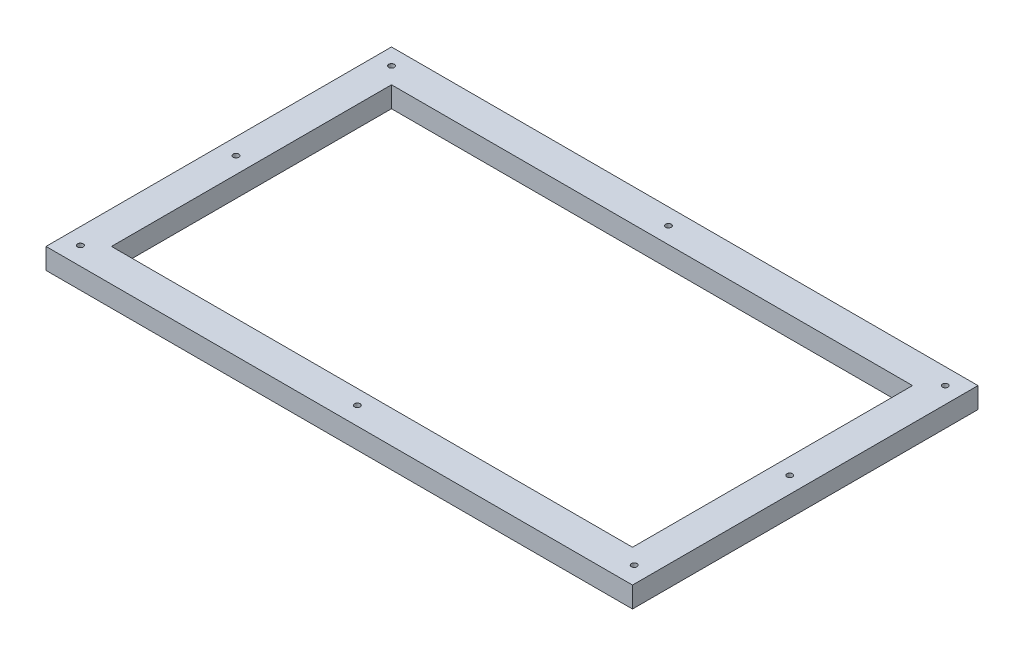
ISO-10303-21;
HEADER;
FILE_DESCRIPTION(('STEP AP214'),'2;1');
FILE_NAME('part.step','',(''),(''),'','','');
FILE_SCHEMA(('AUTOMOTIVE_DESIGN { 1 0 10303 214 1 1 1 1 }'));
ENDSEC;
DATA;
#1=APPLICATION_CONTEXT('core data for automotive mechanical design processes');
#2=APPLICATION_PROTOCOL_DEFINITION('international standard','automotive_design',2000,#1);
#3=PRODUCT_CONTEXT('',#1,'mechanical');
#4=PRODUCT('Part','Part','',(#3));
#5=PRODUCT_RELATED_PRODUCT_CATEGORY('part','',(#4));
#6=PRODUCT_DEFINITION_FORMATION('','',#4);
#7=PRODUCT_DEFINITION_CONTEXT('part definition',#1,'design');
#8=PRODUCT_DEFINITION('design','',#6,#7);
#9=PRODUCT_DEFINITION_SHAPE('','',#8);
#10=(LENGTH_UNIT() NAMED_UNIT(*) SI_UNIT(.MILLI.,.METRE.));
#11=(NAMED_UNIT(*) PLANE_ANGLE_UNIT() SI_UNIT($,.RADIAN.));
#12=(NAMED_UNIT(*) SI_UNIT($,.STERADIAN.) SOLID_ANGLE_UNIT());
#13=UNCERTAINTY_MEASURE_WITH_UNIT(LENGTH_MEASURE(1.E-05),#10,'distance_accuracy_value','');
#14=(GEOMETRIC_REPRESENTATION_CONTEXT(3) GLOBAL_UNCERTAINTY_ASSIGNED_CONTEXT((#13)) GLOBAL_UNIT_ASSIGNED_CONTEXT((#10,
#11,#12)) REPRESENTATION_CONTEXT('',''));
#15=CARTESIAN_POINT('',(0.,0.,0.));
#16=DIRECTION('',(0.,0.,1.));
#17=DIRECTION('',(1.,0.,0.));
#18=AXIS2_PLACEMENT_3D('',#15,#16,#17);
#19=CARTESIAN_POINT('',(179.135,12.7,-105.525));
#20=DIRECTION('',(-1.,0.,0.));
#21=DIRECTION('',(0.,0.,1.));
#22=AXIS2_PLACEMENT_3D('',#19,#20,#21);
#23=PLANE('',#22);
#24=DIRECTION('',(0.,0.,-1.));
#25=VECTOR('',#24,1.);
#26=CARTESIAN_POINT('',(179.135,0.,-105.525));
#27=LINE('',#26,#25);
#28=CARTESIAN_POINT('',(179.135,0.,105.525));
#29=VERTEX_POINT('',#28);
#30=CARTESIAN_POINT('',(179.135,0.,-105.525));
#31=VERTEX_POINT('',#30);
#32=EDGE_CURVE('E145',#29,#31,#27,.T.);
#33=ORIENTED_EDGE('',*,*,#32,.T.);
#34=DIRECTION('',(0.,-1.,0.));
#35=VECTOR('',#34,1.);
#36=CARTESIAN_POINT('',(179.135,12.7,-105.525));
#37=LINE('',#36,#35);
#38=CARTESIAN_POINT('',(179.135,12.7,-105.525));
#39=VERTEX_POINT('',#38);
#40=EDGE_CURVE('E11',#39,#31,#37,.T.);
#41=ORIENTED_EDGE('',*,*,#40,.F.);
#42=DIRECTION('',(0.,0.,-1.));
#43=VECTOR('',#42,1.);
#44=CARTESIAN_POINT('',(179.135,12.7,-105.525));
#45=LINE('',#44,#43);
#46=CARTESIAN_POINT('',(179.135,12.7,105.525));
#47=VERTEX_POINT('',#46);
#48=EDGE_CURVE('E149',#47,#39,#45,.T.);
#49=ORIENTED_EDGE('',*,*,#48,.F.);
#50=DIRECTION('',(0.,-1.,0.));
#51=VECTOR('',#50,1.);
#52=CARTESIAN_POINT('',(179.135,12.7,105.525));
#53=LINE('',#52,#51);
#54=EDGE_CURVE('E159',#47,#29,#53,.T.);
#55=ORIENTED_EDGE('',*,*,#54,.T.);
#56=EDGE_LOOP('',(#33,#41,#49,#55));
#57=FACE_BOUND('',#56,.T.);
#58=ADVANCED_FACE('F45',(#57),#23,.F.);
#59=CARTESIAN_POINT('',(-179.135,12.7,-105.525));
#60=DIRECTION('',(0.,0.,1.));
#61=DIRECTION('',(1.,0.,0.));
#62=AXIS2_PLACEMENT_3D('',#59,#60,#61);
#63=PLANE('',#62);
#64=DIRECTION('',(-1.,0.,0.));
#65=VECTOR('',#64,1.);
#66=CARTESIAN_POINT('',(-179.135,0.,-105.525));
#67=LINE('',#66,#65);
#68=CARTESIAN_POINT('',(-179.135,0.,-105.525));
#69=VERTEX_POINT('',#68);
#70=EDGE_CURVE('E162',#31,#69,#67,.T.);
#71=ORIENTED_EDGE('',*,*,#70,.T.);
#72=DIRECTION('',(0.,-1.,0.));
#73=VECTOR('',#72,1.);
#74=CARTESIAN_POINT('',(-179.135,12.7,-105.525));
#75=LINE('',#74,#73);
#76=CARTESIAN_POINT('',(-179.135,12.7,-105.525));
#77=VERTEX_POINT('',#76);
#78=EDGE_CURVE('E52',#77,#69,#75,.T.);
#79=ORIENTED_EDGE('',*,*,#78,.F.);
#80=DIRECTION('',(-1.,0.,0.));
#81=VECTOR('',#80,1.);
#82=CARTESIAN_POINT('',(-179.135,12.7,-105.525));
#83=LINE('',#82,#81);
#84=EDGE_CURVE('E152',#39,#77,#83,.T.);
#85=ORIENTED_EDGE('',*,*,#84,.F.);
#86=ORIENTED_EDGE('',*,*,#40,.T.);
#87=EDGE_LOOP('',(#71,#79,#85,#86));
#88=FACE_BOUND('',#87,.T.);
#89=ADVANCED_FACE('F190',(#88),#63,.F.);
#90=CARTESIAN_POINT('',(-179.135,12.7,-105.525));
#91=DIRECTION('',(1.,0.,0.));
#92=DIRECTION('',(0.,0.,-1.));
#93=AXIS2_PLACEMENT_3D('',#90,#91,#92);
#94=PLANE('',#93);
#95=DIRECTION('',(0.,0.,1.));
#96=VECTOR('',#95,1.);
#97=CARTESIAN_POINT('',(-179.135,0.,-105.525));
#98=LINE('',#97,#96);
#99=CARTESIAN_POINT('',(-179.135,0.,105.525));
#100=VERTEX_POINT('',#99);
#101=EDGE_CURVE('E164',#69,#100,#98,.T.);
#102=ORIENTED_EDGE('',*,*,#101,.T.);
#103=DIRECTION('',(0.,-1.,0.));
#104=VECTOR('',#103,1.);
#105=CARTESIAN_POINT('',(-179.135,12.7,105.525));
#106=LINE('',#105,#104);
#107=CARTESIAN_POINT('',(-179.135,12.7,105.525));
#108=VERTEX_POINT('',#107);
#109=EDGE_CURVE('E169',#108,#100,#106,.T.);
#110=ORIENTED_EDGE('',*,*,#109,.F.);
#111=DIRECTION('',(0.,0.,1.));
#112=VECTOR('',#111,1.);
#113=CARTESIAN_POINT('',(-179.135,12.7,-105.525));
#114=LINE('',#113,#112);
#115=EDGE_CURVE('E155',#77,#108,#114,.T.);
#116=ORIENTED_EDGE('',*,*,#115,.F.);
#117=ORIENTED_EDGE('',*,*,#78,.T.);
#118=EDGE_LOOP('',(#102,#110,#116,#117));
#119=FACE_BOUND('',#118,.T.);
#120=ADVANCED_FACE('F176',(#119),#94,.F.);
#121=CARTESIAN_POINT('',(-179.135,12.7,105.525));
#122=DIRECTION('',(0.,0.,-1.));
#123=DIRECTION('',(-1.,0.,0.));
#124=AXIS2_PLACEMENT_3D('',#121,#122,#123);
#125=PLANE('',#124);
#126=DIRECTION('',(1.,0.,0.));
#127=VECTOR('',#126,1.);
#128=CARTESIAN_POINT('',(-179.135,0.,105.525));
#129=LINE('',#128,#127);
#130=EDGE_CURVE('E153',#100,#29,#129,.T.);
#131=ORIENTED_EDGE('',*,*,#130,.T.);
#132=ORIENTED_EDGE('',*,*,#54,.F.);
#133=DIRECTION('',(1.,0.,0.));
#134=VECTOR('',#133,1.);
#135=CARTESIAN_POINT('',(-179.135,12.7,105.525));
#136=LINE('',#135,#134);
#137=EDGE_CURVE('E157',#108,#47,#136,.T.);
#138=ORIENTED_EDGE('',*,*,#137,.F.);
#139=ORIENTED_EDGE('',*,*,#109,.T.);
#140=EDGE_LOOP('',(#131,#132,#138,#139));
#141=FACE_BOUND('',#140,.T.);
#142=ADVANCED_FACE('F183',(#141),#125,.F.);
#143=CARTESIAN_POINT('',(0.,12.7,0.));
#144=DIRECTION('',(0.,1.,0.));
#145=DIRECTION('',(0.,0.,1.));
#146=AXIS2_PLACEMENT_3D('',#143,#144,#145);
#147=PLANE('',#146);
#148=CARTESIAN_POINT('',(-169.135,12.7,-95.525));
#149=DIRECTION('',(0.,1.,0.));
#150=DIRECTION('',(0.,0.,1.));
#151=AXIS2_PLACEMENT_3D('',#148,#149,#150);
#152=CIRCLE('',#151,1.725);
#153=CARTESIAN_POINT('',(-169.135,12.7,-93.8));
#154=VERTEX_POINT('',#153);
#155=EDGE_CURVE('E288',#154,#154,#152,.T.);
#156=ORIENTED_EDGE('',*,*,#155,.F.);
#157=EDGE_LOOP('',(#156));
#158=FACE_BOUND('',#157,.T.);
#159=CARTESIAN_POINT('',(-169.135,12.7,-0.524999999999984));
#160=DIRECTION('',(0.,1.,0.));
#161=DIRECTION('',(0.,0.,1.));
#162=AXIS2_PLACEMENT_3D('',#159,#160,#161);
#163=CIRCLE('',#162,1.725);
#164=CARTESIAN_POINT('',(-169.135,12.7,1.20000000000002));
#165=VERTEX_POINT('',#164);
#166=EDGE_CURVE('E295',#165,#165,#163,.T.);
#167=ORIENTED_EDGE('',*,*,#166,.F.);
#168=EDGE_LOOP('',(#167));
#169=FACE_BOUND('',#168,.T.);
#170=CARTESIAN_POINT('',(-169.135,12.7,94.475));
#171=DIRECTION('',(0.,1.,0.));
#172=DIRECTION('',(0.,0.,1.));
#173=AXIS2_PLACEMENT_3D('',#170,#171,#172);
#174=CIRCLE('',#173,1.725);
#175=CARTESIAN_POINT('',(-169.135,12.7,96.2));
#176=VERTEX_POINT('',#175);
#177=EDGE_CURVE('E304',#176,#176,#174,.T.);
#178=ORIENTED_EDGE('',*,*,#177,.F.);
#179=EDGE_LOOP('',(#178));
#180=FACE_BOUND('',#179,.T.);
#181=CARTESIAN_POINT('',(0.,12.7,94.4750000000001));
#182=DIRECTION('',(0.,1.,0.));
#183=DIRECTION('',(0.,0.,1.));
#184=AXIS2_PLACEMENT_3D('',#181,#182,#183);
#185=CIRCLE('',#184,1.725);
#186=CARTESIAN_POINT('',(0.,12.7,96.2000000000001));
#187=VERTEX_POINT('',#186);
#188=EDGE_CURVE('E313',#187,#187,#185,.T.);
#189=ORIENTED_EDGE('',*,*,#188,.F.);
#190=EDGE_LOOP('',(#189));
#191=FACE_BOUND('',#190,.T.);
#192=CARTESIAN_POINT('',(169.135,12.7,94.4750000000001));
#193=DIRECTION('',(0.,1.,0.));
#194=DIRECTION('',(0.,0.,1.));
#195=AXIS2_PLACEMENT_3D('',#192,#193,#194);
#196=CIRCLE('',#195,1.725);
#197=CARTESIAN_POINT('',(169.135,12.7,96.2000000000001));
#198=VERTEX_POINT('',#197);
#199=EDGE_CURVE('E322',#198,#198,#196,.T.);
#200=ORIENTED_EDGE('',*,*,#199,.F.);
#201=EDGE_LOOP('',(#200));
#202=FACE_BOUND('',#201,.T.);
#203=CARTESIAN_POINT('',(169.135,12.7,-0.524999999999901));
#204=DIRECTION('',(0.,1.,0.));
#205=DIRECTION('',(0.,0.,1.));
#206=AXIS2_PLACEMENT_3D('',#203,#204,#205);
#207=CIRCLE('',#206,1.725);
#208=CARTESIAN_POINT('',(169.135,12.7,1.2000000000001));
#209=VERTEX_POINT('',#208);
#210=EDGE_CURVE('E331',#209,#209,#207,.T.);
#211=ORIENTED_EDGE('',*,*,#210,.F.);
#212=EDGE_LOOP('',(#211));
#213=FACE_BOUND('',#212,.T.);
#214=CARTESIAN_POINT('',(169.135,12.7,-95.5249999999999));
#215=DIRECTION('',(0.,1.,0.));
#216=DIRECTION('',(0.,0.,1.));
#217=AXIS2_PLACEMENT_3D('',#214,#215,#216);
#218=CIRCLE('',#217,1.725);
#219=CARTESIAN_POINT('',(169.135,12.7,-93.7999999999999));
#220=VERTEX_POINT('',#219);
#221=EDGE_CURVE('E340',#220,#220,#218,.T.);
#222=ORIENTED_EDGE('',*,*,#221,.F.);
#223=EDGE_LOOP('',(#222));
#224=FACE_BOUND('',#223,.T.);
#225=CARTESIAN_POINT('',(0.,12.7,-95.525));
#226=DIRECTION('',(0.,1.,0.));
#227=DIRECTION('',(0.,0.,1.));
#228=AXIS2_PLACEMENT_3D('',#225,#226,#227);
#229=CIRCLE('',#228,1.725);
#230=CARTESIAN_POINT('',(0.,12.7,-93.8));
#231=VERTEX_POINT('',#230);
#232=EDGE_CURVE('E349',#231,#231,#229,.T.);
#233=ORIENTED_EDGE('',*,*,#232,.F.);
#234=EDGE_LOOP('',(#233));
#235=FACE_BOUND('',#234,.T.);
#236=DIRECTION('',(0.,0.,-1.));
#237=VECTOR('',#236,1.);
#238=CARTESIAN_POINT('',(159.135,12.7,-85.525));
#239=LINE('',#238,#237);
#240=CARTESIAN_POINT('',(159.135,12.7,85.525));
#241=VERTEX_POINT('',#240);
#242=CARTESIAN_POINT('',(159.135,12.7,-85.525));
#243=VERTEX_POINT('',#242);
#244=EDGE_CURVE('E59',#241,#243,#239,.T.);
#245=ORIENTED_EDGE('',*,*,#244,.F.);
#246=DIRECTION('',(1.,0.,0.));
#247=VECTOR('',#246,1.);
#248=CARTESIAN_POINT('',(-159.135,12.7,85.525));
#249=LINE('',#248,#247);
#250=CARTESIAN_POINT('',(-159.135,12.7,85.525));
#251=VERTEX_POINT('',#250);
#252=EDGE_CURVE('E127',#251,#241,#249,.T.);
#253=ORIENTED_EDGE('',*,*,#252,.F.);
#254=DIRECTION('',(0.,0.,1.));
#255=VECTOR('',#254,1.);
#256=CARTESIAN_POINT('',(-159.135,12.7,-85.525));
#257=LINE('',#256,#255);
#258=CARTESIAN_POINT('',(-159.135,12.7,-85.525));
#259=VERTEX_POINT('',#258);
#260=EDGE_CURVE('E130',#259,#251,#257,.T.);
#261=ORIENTED_EDGE('',*,*,#260,.F.);
#262=DIRECTION('',(-1.,0.,0.));
#263=VECTOR('',#262,1.);
#264=CARTESIAN_POINT('',(-159.135,12.7,-85.525));
#265=LINE('',#264,#263);
#266=EDGE_CURVE('E139',#243,#259,#265,.T.);
#267=ORIENTED_EDGE('',*,*,#266,.F.);
#268=EDGE_LOOP('',(#245,#253,#261,#267));
#269=FACE_BOUND('',#268,.T.);
#270=ORIENTED_EDGE('',*,*,#48,.T.);
#271=ORIENTED_EDGE('',*,*,#84,.T.);
#272=ORIENTED_EDGE('',*,*,#115,.T.);
#273=ORIENTED_EDGE('',*,*,#137,.T.);
#274=EDGE_LOOP('',(#270,#271,#272,#273));
#275=FACE_BOUND('',#274,.T.);
#276=ADVANCED_FACE('F189',(#158,#169,#180,#191,#202,#213,#224,#235,#269,#275),#147,.T.);
#277=CARTESIAN_POINT('',(0.,0.,0.));
#278=DIRECTION('',(0.,1.,0.));
#279=DIRECTION('',(0.,0.,1.));
#280=AXIS2_PLACEMENT_3D('',#277,#278,#279);
#281=PLANE('',#280);
#282=CARTESIAN_POINT('',(-169.135,0.,-95.525));
#283=DIRECTION('',(0.,1.,0.));
#284=DIRECTION('',(0.,0.,1.));
#285=AXIS2_PLACEMENT_3D('',#282,#283,#284);
#286=CIRCLE('',#285,1.70000000000001);
#287=CARTESIAN_POINT('',(-169.135,0.,-93.825));
#288=VERTEX_POINT('',#287);
#289=EDGE_CURVE('E290',#288,#288,#286,.T.);
#290=ORIENTED_EDGE('',*,*,#289,.T.);
#291=EDGE_LOOP('',(#290));
#292=FACE_BOUND('',#291,.T.);
#293=CARTESIAN_POINT('',(-169.135,0.,-0.524999999999984));
#294=DIRECTION('',(0.,1.,0.));
#295=DIRECTION('',(0.,0.,1.));
#296=AXIS2_PLACEMENT_3D('',#293,#294,#295);
#297=CIRCLE('',#296,1.70000000000001);
#298=CARTESIAN_POINT('',(-169.135,0.,1.17500000000002));
#299=VERTEX_POINT('',#298);
#300=EDGE_CURVE('E301',#299,#299,#297,.T.);
#301=ORIENTED_EDGE('',*,*,#300,.T.);
#302=EDGE_LOOP('',(#301));
#303=FACE_BOUND('',#302,.T.);
#304=CARTESIAN_POINT('',(-169.135,0.,94.475));
#305=DIRECTION('',(0.,1.,0.));
#306=DIRECTION('',(0.,0.,1.));
#307=AXIS2_PLACEMENT_3D('',#304,#305,#306);
#308=CIRCLE('',#307,1.70000000000001);
#309=CARTESIAN_POINT('',(-169.135,0.,96.175));
#310=VERTEX_POINT('',#309);
#311=EDGE_CURVE('E310',#310,#310,#308,.T.);
#312=ORIENTED_EDGE('',*,*,#311,.T.);
#313=EDGE_LOOP('',(#312));
#314=FACE_BOUND('',#313,.T.);
#315=CARTESIAN_POINT('',(0.,0.,94.4750000000001));
#316=DIRECTION('',(0.,1.,0.));
#317=DIRECTION('',(0.,0.,1.));
#318=AXIS2_PLACEMENT_3D('',#315,#316,#317);
#319=CIRCLE('',#318,1.7);
#320=CARTESIAN_POINT('',(0.,0.,96.1750000000001));
#321=VERTEX_POINT('',#320);
#322=EDGE_CURVE('E319',#321,#321,#319,.T.);
#323=ORIENTED_EDGE('',*,*,#322,.T.);
#324=EDGE_LOOP('',(#323));
#325=FACE_BOUND('',#324,.T.);
#326=CARTESIAN_POINT('',(169.135,0.,94.4750000000001));
#327=DIRECTION('',(0.,1.,0.));
#328=DIRECTION('',(0.,0.,1.));
#329=AXIS2_PLACEMENT_3D('',#326,#327,#328);
#330=CIRCLE('',#329,1.70000000000001);
#331=CARTESIAN_POINT('',(169.135,0.,96.1750000000001));
#332=VERTEX_POINT('',#331);
#333=EDGE_CURVE('E328',#332,#332,#330,.T.);
#334=ORIENTED_EDGE('',*,*,#333,.T.);
#335=EDGE_LOOP('',(#334));
#336=FACE_BOUND('',#335,.T.);
#337=CARTESIAN_POINT('',(169.135,0.,-0.524999999999901));
#338=DIRECTION('',(0.,1.,0.));
#339=DIRECTION('',(0.,0.,1.));
#340=AXIS2_PLACEMENT_3D('',#337,#338,#339);
#341=CIRCLE('',#340,1.70000000000001);
#342=CARTESIAN_POINT('',(169.135,0.,1.17500000000011));
#343=VERTEX_POINT('',#342);
#344=EDGE_CURVE('E337',#343,#343,#341,.T.);
#345=ORIENTED_EDGE('',*,*,#344,.T.);
#346=EDGE_LOOP('',(#345));
#347=FACE_BOUND('',#346,.T.);
#348=CARTESIAN_POINT('',(169.135,0.,-95.5249999999999));
#349=DIRECTION('',(0.,1.,0.));
#350=DIRECTION('',(0.,0.,1.));
#351=AXIS2_PLACEMENT_3D('',#348,#349,#350);
#352=CIRCLE('',#351,1.70000000000001);
#353=CARTESIAN_POINT('',(169.135,0.,-93.8249999999999));
#354=VERTEX_POINT('',#353);
#355=EDGE_CURVE('E346',#354,#354,#352,.T.);
#356=ORIENTED_EDGE('',*,*,#355,.T.);
#357=EDGE_LOOP('',(#356));
#358=FACE_BOUND('',#357,.T.);
#359=CARTESIAN_POINT('',(0.,0.,-95.525));
#360=DIRECTION('',(0.,1.,0.));
#361=DIRECTION('',(0.,0.,1.));
#362=AXIS2_PLACEMENT_3D('',#359,#360,#361);
#363=CIRCLE('',#362,1.7);
#364=CARTESIAN_POINT('',(0.,0.,-93.825));
#365=VERTEX_POINT('',#364);
#366=EDGE_CURVE('E133',#365,#365,#363,.T.);
#367=ORIENTED_EDGE('',*,*,#366,.T.);
#368=EDGE_LOOP('',(#367));
#369=FACE_BOUND('',#368,.T.);
#370=DIRECTION('',(1.,0.,0.));
#371=VECTOR('',#370,1.);
#372=CARTESIAN_POINT('',(-159.135,0.,85.525));
#373=LINE('',#372,#371);
#374=CARTESIAN_POINT('',(-159.135,0.,85.525));
#375=VERTEX_POINT('',#374);
#376=CARTESIAN_POINT('',(159.135,0.,85.525));
#377=VERTEX_POINT('',#376);
#378=EDGE_CURVE('E117',#375,#377,#373,.T.);
#379=ORIENTED_EDGE('',*,*,#378,.T.);
#380=DIRECTION('',(0.,0.,-1.));
#381=VECTOR('',#380,1.);
#382=CARTESIAN_POINT('',(159.135,0.,-85.525));
#383=LINE('',#382,#381);
#384=CARTESIAN_POINT('',(159.135,0.,-85.525));
#385=VERTEX_POINT('',#384);
#386=EDGE_CURVE('E111',#377,#385,#383,.T.);
#387=ORIENTED_EDGE('',*,*,#386,.T.);
#388=DIRECTION('',(-1.,0.,0.));
#389=VECTOR('',#388,1.);
#390=CARTESIAN_POINT('',(-159.135,0.,-85.525));
#391=LINE('',#390,#389);
#392=CARTESIAN_POINT('',(-159.135,0.,-85.525));
#393=VERTEX_POINT('',#392);
#394=EDGE_CURVE('E120',#385,#393,#391,.T.);
#395=ORIENTED_EDGE('',*,*,#394,.T.);
#396=DIRECTION('',(0.,0.,1.));
#397=VECTOR('',#396,1.);
#398=CARTESIAN_POINT('',(-159.135,0.,-85.525));
#399=LINE('',#398,#397);
#400=EDGE_CURVE('E67',#393,#375,#399,.T.);
#401=ORIENTED_EDGE('',*,*,#400,.T.);
#402=EDGE_LOOP('',(#379,#387,#395,#401));
#403=FACE_BOUND('',#402,.T.);
#404=ORIENTED_EDGE('',*,*,#32,.F.);
#405=ORIENTED_EDGE('',*,*,#130,.F.);
#406=ORIENTED_EDGE('',*,*,#101,.F.);
#407=ORIENTED_EDGE('',*,*,#70,.F.);
#408=EDGE_LOOP('',(#404,#405,#406,#407));
#409=FACE_BOUND('',#408,.T.);
#410=ADVANCED_FACE('F124',(#292,#303,#314,#325,#336,#347,#358,#369,#403,#409),#281,.F.);
#411=CARTESIAN_POINT('',(159.135,0.,-85.525));
#412=DIRECTION('',(1.,0.,0.));
#413=DIRECTION('',(0.,0.,-1.));
#414=AXIS2_PLACEMENT_3D('',#411,#412,#413);
#415=PLANE('',#414);
#416=ORIENTED_EDGE('',*,*,#244,.T.);
#417=DIRECTION('',(0.,1.,0.));
#418=VECTOR('',#417,1.);
#419=CARTESIAN_POINT('',(159.135,0.,-85.525));
#420=LINE('',#419,#418);
#421=EDGE_CURVE('E107',#385,#243,#420,.T.);
#422=ORIENTED_EDGE('',*,*,#421,.F.);
#423=ORIENTED_EDGE('',*,*,#386,.F.);
#424=DIRECTION('',(0.,1.,0.));
#425=VECTOR('',#424,1.);
#426=CARTESIAN_POINT('',(159.135,0.,85.525));
#427=LINE('',#426,#425);
#428=EDGE_CURVE('E143',#377,#241,#427,.T.);
#429=ORIENTED_EDGE('',*,*,#428,.T.);
#430=EDGE_LOOP('',(#416,#422,#423,#429));
#431=FACE_BOUND('',#430,.T.);
#432=ADVANCED_FACE('F109',(#431),#415,.F.);
#433=CARTESIAN_POINT('',(-159.135,0.,85.525));
#434=DIRECTION('',(0.,0.,1.));
#435=DIRECTION('',(1.,0.,0.));
#436=AXIS2_PLACEMENT_3D('',#433,#434,#435);
#437=PLANE('',#436);
#438=ORIENTED_EDGE('',*,*,#252,.T.);
#439=ORIENTED_EDGE('',*,*,#428,.F.);
#440=ORIENTED_EDGE('',*,*,#378,.F.);
#441=DIRECTION('',(0.,1.,0.));
#442=VECTOR('',#441,1.);
#443=CARTESIAN_POINT('',(-159.135,0.,85.525));
#444=LINE('',#443,#442);
#445=EDGE_CURVE('E146',#375,#251,#444,.T.);
#446=ORIENTED_EDGE('',*,*,#445,.T.);
#447=EDGE_LOOP('',(#438,#439,#440,#446));
#448=FACE_BOUND('',#447,.T.);
#449=ADVANCED_FACE('F208',(#448),#437,.F.);
#450=CARTESIAN_POINT('',(-159.135,0.,-85.525));
#451=DIRECTION('',(-1.,0.,0.));
#452=DIRECTION('',(0.,0.,1.));
#453=AXIS2_PLACEMENT_3D('',#450,#451,#452);
#454=PLANE('',#453);
#455=ORIENTED_EDGE('',*,*,#260,.T.);
#456=ORIENTED_EDGE('',*,*,#445,.F.);
#457=ORIENTED_EDGE('',*,*,#400,.F.);
#458=DIRECTION('',(0.,1.,0.));
#459=VECTOR('',#458,1.);
#460=CARTESIAN_POINT('',(-159.135,0.,-85.525));
#461=LINE('',#460,#459);
#462=EDGE_CURVE('E116',#393,#259,#461,.T.);
#463=ORIENTED_EDGE('',*,*,#462,.T.);
#464=EDGE_LOOP('',(#455,#456,#457,#463));
#465=FACE_BOUND('',#464,.T.);
#466=ADVANCED_FACE('F212',(#465),#454,.F.);
#467=CARTESIAN_POINT('',(-159.135,0.,-85.525));
#468=DIRECTION('',(0.,0.,-1.));
#469=DIRECTION('',(-1.,0.,0.));
#470=AXIS2_PLACEMENT_3D('',#467,#468,#469);
#471=PLANE('',#470);
#472=ORIENTED_EDGE('',*,*,#266,.T.);
#473=ORIENTED_EDGE('',*,*,#462,.F.);
#474=ORIENTED_EDGE('',*,*,#394,.F.);
#475=ORIENTED_EDGE('',*,*,#421,.T.);
#476=EDGE_LOOP('',(#472,#473,#474,#475));
#477=FACE_BOUND('',#476,.T.);
#478=ADVANCED_FACE('F121',(#477),#471,.F.);
#479=CARTESIAN_POINT('',(0.,12.7,-95.525));
#480=DIRECTION('',(0.,1.,0.));
#481=DIRECTION('',(0.,0.,1.));
#482=AXIS2_PLACEMENT_3D('',#479,#480,#481);
#483=CYLINDRICAL_SURFACE('',#482,1.69999999999999);
#484=ORIENTED_EDGE('',*,*,#366,.F.);
#485=EDGE_LOOP('',(#484));
#486=FACE_BOUND('',#485,.T.);
#487=CARTESIAN_POINT('',(0.,12.675,-95.525));
#488=DIRECTION('',(0.,1.,0.));
#489=DIRECTION('',(0.,0.,1.));
#490=AXIS2_PLACEMENT_3D('',#487,#488,#489);
#491=CIRCLE('',#490,1.69999999999999);
#492=CARTESIAN_POINT('',(0.,12.675,-93.825));
#493=VERTEX_POINT('',#492);
#494=EDGE_CURVE('E351',#493,#493,#491,.T.);
#495=ORIENTED_EDGE('',*,*,#494,.T.);
#496=EDGE_LOOP('',(#495));
#497=FACE_BOUND('',#496,.T.);
#498=ADVANCED_FACE('F211',(#486,#497),#483,.F.);
#499=CARTESIAN_POINT('',(0.,12.7,-95.525));
#500=DIRECTION('',(0.,1.,0.));
#501=DIRECTION('',(0.,0.,1.));
#502=AXIS2_PLACEMENT_3D('',#499,#500,#501);
#503=CONICAL_SURFACE('',#502,1.725,0.785398163397171);
#504=ORIENTED_EDGE('',*,*,#494,.F.);
#505=EDGE_LOOP('',(#504));
#506=FACE_BOUND('',#505,.T.);
#507=ORIENTED_EDGE('',*,*,#232,.T.);
#508=EDGE_LOOP('',(#507));
#509=FACE_BOUND('',#508,.T.);
#510=ADVANCED_FACE('F220',(#506,#509),#503,.F.);
#511=CARTESIAN_POINT('',(169.135,12.7,-95.5249999999999));
#512=DIRECTION('',(0.,1.,0.));
#513=DIRECTION('',(0.,0.,1.));
#514=AXIS2_PLACEMENT_3D('',#511,#512,#513);
#515=CYLINDRICAL_SURFACE('',#514,1.69999999999999);
#516=ORIENTED_EDGE('',*,*,#355,.F.);
#517=EDGE_LOOP('',(#516));
#518=FACE_BOUND('',#517,.T.);
#519=CARTESIAN_POINT('',(169.135,12.675,-95.5249999999999));
#520=DIRECTION('',(0.,1.,0.));
#521=DIRECTION('',(0.,0.,1.));
#522=AXIS2_PLACEMENT_3D('',#519,#520,#521);
#523=CIRCLE('',#522,1.69999999999998);
#524=CARTESIAN_POINT('',(169.135,12.675,-93.8249999999999));
#525=VERTEX_POINT('',#524);
#526=EDGE_CURVE('E343',#525,#525,#523,.T.);
#527=ORIENTED_EDGE('',*,*,#526,.T.);
#528=EDGE_LOOP('',(#527));
#529=FACE_BOUND('',#528,.T.);
#530=ADVANCED_FACE('F224',(#518,#529),#515,.F.);
#531=CARTESIAN_POINT('',(169.135,12.7,-95.5249999999999));
#532=DIRECTION('',(0.,1.,0.));
#533=DIRECTION('',(0.,0.,1.));
#534=AXIS2_PLACEMENT_3D('',#531,#532,#533);
#535=CONICAL_SURFACE('',#534,1.725,0.785398163397414);
#536=ORIENTED_EDGE('',*,*,#526,.F.);
#537=EDGE_LOOP('',(#536));
#538=FACE_BOUND('',#537,.T.);
#539=ORIENTED_EDGE('',*,*,#221,.T.);
#540=EDGE_LOOP('',(#539));
#541=FACE_BOUND('',#540,.T.);
#542=ADVANCED_FACE('F228',(#538,#541),#535,.F.);
#543=CARTESIAN_POINT('',(169.135,12.7,-0.524999999999901));
#544=DIRECTION('',(0.,1.,0.));
#545=DIRECTION('',(0.,0.,1.));
#546=AXIS2_PLACEMENT_3D('',#543,#544,#545);
#547=CYLINDRICAL_SURFACE('',#546,1.69999999999999);
#548=ORIENTED_EDGE('',*,*,#344,.F.);
#549=EDGE_LOOP('',(#548));
#550=FACE_BOUND('',#549,.T.);
#551=CARTESIAN_POINT('',(169.135,12.675,-0.524999999999901));
#552=DIRECTION('',(0.,1.,0.));
#553=DIRECTION('',(0.,0.,1.));
#554=AXIS2_PLACEMENT_3D('',#551,#552,#553);
#555=CIRCLE('',#554,1.69999999999998);
#556=CARTESIAN_POINT('',(169.135,12.675,1.17500000000008));
#557=VERTEX_POINT('',#556);
#558=EDGE_CURVE('E334',#557,#557,#555,.T.);
#559=ORIENTED_EDGE('',*,*,#558,.T.);
#560=EDGE_LOOP('',(#559));
#561=FACE_BOUND('',#560,.T.);
#562=ADVANCED_FACE('F232',(#550,#561),#547,.F.);
#563=CARTESIAN_POINT('',(169.135,12.7,-0.524999999999901));
#564=DIRECTION('',(0.,1.,0.));
#565=DIRECTION('',(0.,0.,1.));
#566=AXIS2_PLACEMENT_3D('',#563,#564,#565);
#567=CONICAL_SURFACE('',#566,1.725,0.785398163397414);
#568=ORIENTED_EDGE('',*,*,#558,.F.);
#569=EDGE_LOOP('',(#568));
#570=FACE_BOUND('',#569,.T.);
#571=ORIENTED_EDGE('',*,*,#210,.T.);
#572=EDGE_LOOP('',(#571));
#573=FACE_BOUND('',#572,.T.);
#574=ADVANCED_FACE('F236',(#570,#573),#567,.F.);
#575=CARTESIAN_POINT('',(169.135,12.7,94.4750000000001));
#576=DIRECTION('',(0.,1.,0.));
#577=DIRECTION('',(0.,0.,1.));
#578=AXIS2_PLACEMENT_3D('',#575,#576,#577);
#579=CYLINDRICAL_SURFACE('',#578,1.69999999999999);
#580=ORIENTED_EDGE('',*,*,#333,.F.);
#581=EDGE_LOOP('',(#580));
#582=FACE_BOUND('',#581,.T.);
#583=CARTESIAN_POINT('',(169.135,12.675,94.4750000000001));
#584=DIRECTION('',(0.,1.,0.));
#585=DIRECTION('',(0.,0.,1.));
#586=AXIS2_PLACEMENT_3D('',#583,#584,#585);
#587=CIRCLE('',#586,1.69999999999998);
#588=CARTESIAN_POINT('',(169.135,12.675,96.1750000000001));
#589=VERTEX_POINT('',#588);
#590=EDGE_CURVE('E325',#589,#589,#587,.T.);
#591=ORIENTED_EDGE('',*,*,#590,.T.);
#592=EDGE_LOOP('',(#591));
#593=FACE_BOUND('',#592,.T.);
#594=ADVANCED_FACE('F240',(#582,#593),#579,.F.);
#595=CARTESIAN_POINT('',(169.135,12.7,94.4750000000001));
#596=DIRECTION('',(0.,1.,0.));
#597=DIRECTION('',(0.,0.,1.));
#598=AXIS2_PLACEMENT_3D('',#595,#596,#597);
#599=CONICAL_SURFACE('',#598,1.725,0.785398163397414);
#600=ORIENTED_EDGE('',*,*,#590,.F.);
#601=EDGE_LOOP('',(#600));
#602=FACE_BOUND('',#601,.T.);
#603=ORIENTED_EDGE('',*,*,#199,.T.);
#604=EDGE_LOOP('',(#603));
#605=FACE_BOUND('',#604,.T.);
#606=ADVANCED_FACE('F244',(#602,#605),#599,.F.);
#607=CARTESIAN_POINT('',(0.,12.7,94.4750000000001));
#608=DIRECTION('',(0.,1.,0.));
#609=DIRECTION('',(0.,0.,1.));
#610=AXIS2_PLACEMENT_3D('',#607,#608,#609);
#611=CYLINDRICAL_SURFACE('',#610,1.69999999999999);
#612=ORIENTED_EDGE('',*,*,#322,.F.);
#613=EDGE_LOOP('',(#612));
#614=FACE_BOUND('',#613,.T.);
#615=CARTESIAN_POINT('',(0.,12.675,94.4750000000001));
#616=DIRECTION('',(0.,1.,0.));
#617=DIRECTION('',(0.,0.,1.));
#618=AXIS2_PLACEMENT_3D('',#615,#616,#617);
#619=CIRCLE('',#618,1.69999999999999);
#620=CARTESIAN_POINT('',(0.,12.675,96.1750000000001));
#621=VERTEX_POINT('',#620);
#622=EDGE_CURVE('E316',#621,#621,#619,.T.);
#623=ORIENTED_EDGE('',*,*,#622,.T.);
#624=EDGE_LOOP('',(#623));
#625=FACE_BOUND('',#624,.T.);
#626=ADVANCED_FACE('F248',(#614,#625),#611,.F.);
#627=CARTESIAN_POINT('',(0.,12.7,94.4750000000001));
#628=DIRECTION('',(0.,1.,0.));
#629=DIRECTION('',(0.,0.,1.));
#630=AXIS2_PLACEMENT_3D('',#627,#628,#629);
#631=CONICAL_SURFACE('',#630,1.725,0.785398163397171);
#632=ORIENTED_EDGE('',*,*,#622,.F.);
#633=EDGE_LOOP('',(#632));
#634=FACE_BOUND('',#633,.T.);
#635=ORIENTED_EDGE('',*,*,#188,.T.);
#636=EDGE_LOOP('',(#635));
#637=FACE_BOUND('',#636,.T.);
#638=ADVANCED_FACE('F252',(#634,#637),#631,.F.);
#639=CARTESIAN_POINT('',(-169.135,12.7,94.475));
#640=DIRECTION('',(0.,1.,0.));
#641=DIRECTION('',(0.,0.,1.));
#642=AXIS2_PLACEMENT_3D('',#639,#640,#641);
#643=CYLINDRICAL_SURFACE('',#642,1.69999999999999);
#644=ORIENTED_EDGE('',*,*,#311,.F.);
#645=EDGE_LOOP('',(#644));
#646=FACE_BOUND('',#645,.T.);
#647=CARTESIAN_POINT('',(-169.135,12.675,94.475));
#648=DIRECTION('',(0.,1.,0.));
#649=DIRECTION('',(0.,0.,1.));
#650=AXIS2_PLACEMENT_3D('',#647,#648,#649);
#651=CIRCLE('',#650,1.69999999999998);
#652=CARTESIAN_POINT('',(-169.135,12.675,96.175));
#653=VERTEX_POINT('',#652);
#654=EDGE_CURVE('E307',#653,#653,#651,.T.);
#655=ORIENTED_EDGE('',*,*,#654,.T.);
#656=EDGE_LOOP('',(#655));
#657=FACE_BOUND('',#656,.T.);
#658=ADVANCED_FACE('F256',(#646,#657),#643,.F.);
#659=CARTESIAN_POINT('',(-169.135,12.7,94.475));
#660=DIRECTION('',(0.,1.,0.));
#661=DIRECTION('',(0.,0.,1.));
#662=AXIS2_PLACEMENT_3D('',#659,#660,#661);
#663=CONICAL_SURFACE('',#662,1.725,0.785398163397414);
#664=ORIENTED_EDGE('',*,*,#654,.F.);
#665=EDGE_LOOP('',(#664));
#666=FACE_BOUND('',#665,.T.);
#667=ORIENTED_EDGE('',*,*,#177,.T.);
#668=EDGE_LOOP('',(#667));
#669=FACE_BOUND('',#668,.T.);
#670=ADVANCED_FACE('F260',(#666,#669),#663,.F.);
#671=CARTESIAN_POINT('',(-169.135,12.7,-0.524999999999984));
#672=DIRECTION('',(0.,1.,0.));
#673=DIRECTION('',(0.,0.,1.));
#674=AXIS2_PLACEMENT_3D('',#671,#672,#673);
#675=CYLINDRICAL_SURFACE('',#674,1.69999999999999);
#676=ORIENTED_EDGE('',*,*,#300,.F.);
#677=EDGE_LOOP('',(#676));
#678=FACE_BOUND('',#677,.T.);
#679=CARTESIAN_POINT('',(-169.135,12.675,-0.524999999999984));
#680=DIRECTION('',(0.,1.,0.));
#681=DIRECTION('',(0.,0.,1.));
#682=AXIS2_PLACEMENT_3D('',#679,#680,#681);
#683=CIRCLE('',#682,1.69999999999998);
#684=CARTESIAN_POINT('',(-169.135,12.675,1.175));
#685=VERTEX_POINT('',#684);
#686=EDGE_CURVE('E298',#685,#685,#683,.T.);
#687=ORIENTED_EDGE('',*,*,#686,.T.);
#688=EDGE_LOOP('',(#687));
#689=FACE_BOUND('',#688,.T.);
#690=ADVANCED_FACE('F264',(#678,#689),#675,.F.);
#691=CARTESIAN_POINT('',(-169.135,12.7,-0.524999999999984));
#692=DIRECTION('',(0.,1.,0.));
#693=DIRECTION('',(0.,0.,1.));
#694=AXIS2_PLACEMENT_3D('',#691,#692,#693);
#695=CONICAL_SURFACE('',#694,1.725,0.785398163397414);
#696=ORIENTED_EDGE('',*,*,#686,.F.);
#697=EDGE_LOOP('',(#696));
#698=FACE_BOUND('',#697,.T.);
#699=ORIENTED_EDGE('',*,*,#166,.T.);
#700=EDGE_LOOP('',(#699));
#701=FACE_BOUND('',#700,.T.);
#702=ADVANCED_FACE('F268',(#698,#701),#695,.F.);
#703=CARTESIAN_POINT('',(-169.135,12.7,-95.525));
#704=DIRECTION('',(0.,1.,0.));
#705=DIRECTION('',(0.,0.,1.));
#706=AXIS2_PLACEMENT_3D('',#703,#704,#705);
#707=CYLINDRICAL_SURFACE('',#706,1.69999999999999);
#708=ORIENTED_EDGE('',*,*,#289,.F.);
#709=EDGE_LOOP('',(#708));
#710=FACE_BOUND('',#709,.T.);
#711=CARTESIAN_POINT('',(-169.135,12.675,-95.525));
#712=DIRECTION('',(0.,1.,0.));
#713=DIRECTION('',(0.,0.,1.));
#714=AXIS2_PLACEMENT_3D('',#711,#712,#713);
#715=CIRCLE('',#714,1.69999999999998);
#716=CARTESIAN_POINT('',(-169.135,12.675,-93.825));
#717=VERTEX_POINT('',#716);
#718=EDGE_CURVE('E285',#717,#717,#715,.T.);
#719=ORIENTED_EDGE('',*,*,#718,.T.);
#720=EDGE_LOOP('',(#719));
#721=FACE_BOUND('',#720,.T.);
#722=ADVANCED_FACE('F272',(#710,#721),#707,.F.);
#723=CARTESIAN_POINT('',(-169.135,12.7,-95.525));
#724=DIRECTION('',(0.,1.,0.));
#725=DIRECTION('',(0.,0.,1.));
#726=AXIS2_PLACEMENT_3D('',#723,#724,#725);
#727=CONICAL_SURFACE('',#726,1.725,0.785398163397414);
#728=ORIENTED_EDGE('',*,*,#718,.F.);
#729=EDGE_LOOP('',(#728));
#730=FACE_BOUND('',#729,.T.);
#731=ORIENTED_EDGE('',*,*,#155,.T.);
#732=EDGE_LOOP('',(#731));
#733=FACE_BOUND('',#732,.T.);
#734=ADVANCED_FACE('F276',(#730,#733),#727,.F.);
#735=CLOSED_SHELL('',(#58,#89,#120,#142,#276,#410,#432,#449,#466,#478,#498,#510,#530,#542,#562,
#574,#594,#606,#626,#638,#658,#670,#690,#702,#722,#734));
#736=MANIFOLD_SOLID_BREP('B2',#735);
#737=ADVANCED_BREP_SHAPE_REPRESENTATION('',(#18,#736),#14);
#738=SHAPE_DEFINITION_REPRESENTATION(#9,#737);
ENDSEC;
END-ISO-10303-21;
